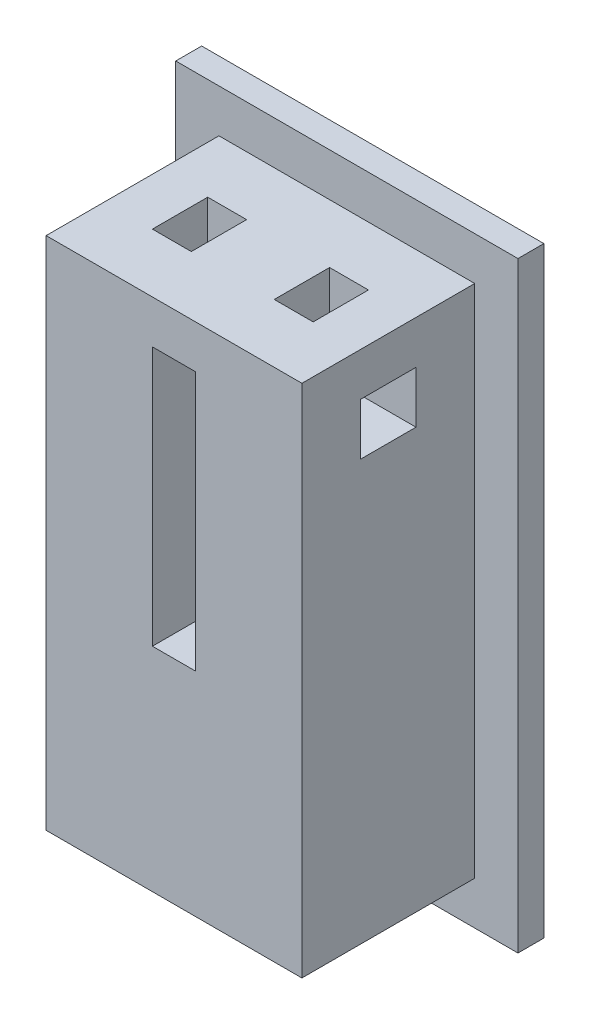
ISO-10303-21;
HEADER;
FILE_DESCRIPTION(('STEP AP214'),'2;1');
FILE_NAME('part.step','',(''),(''),'','','');
FILE_SCHEMA(('AUTOMOTIVE_DESIGN { 1 0 10303 214 1 1 1 1 }'));
ENDSEC;
DATA;
#1=APPLICATION_CONTEXT('core data for automotive mechanical design processes');
#2=APPLICATION_PROTOCOL_DEFINITION('international standard','automotive_design',2000,#1);
#3=PRODUCT_CONTEXT('',#1,'mechanical');
#4=PRODUCT('Part','Part','',(#3));
#5=PRODUCT_RELATED_PRODUCT_CATEGORY('part','',(#4));
#6=PRODUCT_DEFINITION_FORMATION('','',#4);
#7=PRODUCT_DEFINITION_CONTEXT('part definition',#1,'design');
#8=PRODUCT_DEFINITION('design','',#6,#7);
#9=PRODUCT_DEFINITION_SHAPE('','',#8);
#10=(LENGTH_UNIT() NAMED_UNIT(*) SI_UNIT(.MILLI.,.METRE.));
#11=(NAMED_UNIT(*) PLANE_ANGLE_UNIT() SI_UNIT($,.RADIAN.));
#12=(NAMED_UNIT(*) SI_UNIT($,.STERADIAN.) SOLID_ANGLE_UNIT());
#13=UNCERTAINTY_MEASURE_WITH_UNIT(LENGTH_MEASURE(1.E-05),#10,'distance_accuracy_value','');
#14=(GEOMETRIC_REPRESENTATION_CONTEXT(3) GLOBAL_UNCERTAINTY_ASSIGNED_CONTEXT((#13)) GLOBAL_UNIT_ASSIGNED_CONTEXT((#10,
#11,#12)) REPRESENTATION_CONTEXT('',''));
#15=CARTESIAN_POINT('',(0.,0.,0.));
#16=DIRECTION('',(0.,0.,1.));
#17=DIRECTION('',(1.,0.,0.));
#18=AXIS2_PLACEMENT_3D('',#15,#16,#17);
#19=CARTESIAN_POINT('',(0.,0.,20.));
#20=DIRECTION('',(0.,0.,1.));
#21=DIRECTION('',(1.,0.,0.));
#22=AXIS2_PLACEMENT_3D('',#19,#20,#21);
#23=PLANE('',#22);
#24=DIRECTION('',(0.,-1.,0.));
#25=VECTOR('',#24,1.);
#26=CARTESIAN_POINT('',(-14.8,29.8,20.));
#27=LINE('',#26,#25);
#28=CARTESIAN_POINT('',(-14.8,29.8,20.));
#29=VERTEX_POINT('',#28);
#30=CARTESIAN_POINT('',(-14.8,-29.8,20.));
#31=VERTEX_POINT('',#30);
#32=EDGE_CURVE('E401',#29,#31,#27,.T.);
#33=ORIENTED_EDGE('',*,*,#32,.T.);
#34=DIRECTION('',(1.,0.,0.));
#35=VECTOR('',#34,1.);
#36=CARTESIAN_POINT('',(-14.8,-29.8,20.));
#37=LINE('',#36,#35);
#38=CARTESIAN_POINT('',(14.8,-29.8,20.));
#39=VERTEX_POINT('',#38);
#40=EDGE_CURVE('E404',#31,#39,#37,.T.);
#41=ORIENTED_EDGE('',*,*,#40,.T.);
#42=DIRECTION('',(0.,1.,0.));
#43=VECTOR('',#42,1.);
#44=CARTESIAN_POINT('',(14.8,29.8,20.));
#45=LINE('',#44,#43);
#46=CARTESIAN_POINT('',(14.8,29.8,20.));
#47=VERTEX_POINT('',#46);
#48=EDGE_CURVE('E407',#39,#47,#45,.T.);
#49=ORIENTED_EDGE('',*,*,#48,.T.);
#50=DIRECTION('',(-1.,0.,0.));
#51=VECTOR('',#50,1.);
#52=CARTESIAN_POINT('',(-14.8,29.8,20.));
#53=LINE('',#52,#51);
#54=EDGE_CURVE('E409',#47,#29,#53,.T.);
#55=ORIENTED_EDGE('',*,*,#54,.T.);
#56=EDGE_LOOP('',(#33,#41,#49,#55));
#57=FACE_BOUND('',#56,.T.);
#58=DIRECTION('',(1.,0.,0.));
#59=VECTOR('',#58,1.);
#60=CARTESIAN_POINT('',(-2.5,-5.19999999999999,20.));
#61=LINE('',#60,#59);
#62=CARTESIAN_POINT('',(-2.5,-5.19999999999999,20.));
#63=VERTEX_POINT('',#62);
#64=CARTESIAN_POINT('',(2.5,-5.19999999999999,20.));
#65=VERTEX_POINT('',#64);
#66=EDGE_CURVE('E381',#63,#65,#61,.T.);
#67=ORIENTED_EDGE('',*,*,#66,.F.);
#68=DIRECTION('',(0.,-1.,0.));
#69=VECTOR('',#68,1.);
#70=CARTESIAN_POINT('',(-2.5,24.8,20.));
#71=LINE('',#70,#69);
#72=CARTESIAN_POINT('',(-2.5,24.8,20.));
#73=VERTEX_POINT('',#72);
#74=EDGE_CURVE('E379',#73,#63,#71,.T.);
#75=ORIENTED_EDGE('',*,*,#74,.F.);
#76=DIRECTION('',(-1.,0.,0.));
#77=VECTOR('',#76,1.);
#78=CARTESIAN_POINT('',(-2.5,24.8,20.));
#79=LINE('',#78,#77);
#80=CARTESIAN_POINT('',(2.5,24.8,20.));
#81=VERTEX_POINT('',#80);
#82=EDGE_CURVE('E386',#81,#73,#79,.T.);
#83=ORIENTED_EDGE('',*,*,#82,.F.);
#84=DIRECTION('',(0.,1.,0.));
#85=VECTOR('',#84,1.);
#86=CARTESIAN_POINT('',(2.5,24.8,20.));
#87=LINE('',#86,#85);
#88=EDGE_CURVE('E383',#65,#81,#87,.T.);
#89=ORIENTED_EDGE('',*,*,#88,.F.);
#90=EDGE_LOOP('',(#67,#75,#83,#89));
#91=FACE_BOUND('',#90,.T.);
#92=ADVANCED_FACE('F37',(#57,#91),#23,.T.);
#93=CARTESIAN_POINT('',(-14.8,29.8,20.));
#94=DIRECTION('',(1.,0.,0.));
#95=DIRECTION('',(0.,0.,-1.));
#96=AXIS2_PLACEMENT_3D('',#93,#94,#95);
#97=PLANE('',#96);
#98=DIRECTION('',(0.,0.,1.));
#99=VECTOR('',#98,1.);
#100=CARTESIAN_POINT('',(-14.8,18.8,6.8));
#101=LINE('',#100,#99);
#102=CARTESIAN_POINT('',(-14.8,18.8,6.8));
#103=VERTEX_POINT('',#102);
#104=CARTESIAN_POINT('',(-14.8,18.8,13.2));
#105=VERTEX_POINT('',#104);
#106=EDGE_CURVE('E237',#103,#105,#101,.T.);
#107=ORIENTED_EDGE('',*,*,#106,.F.);
#108=DIRECTION('',(0.,-1.,0.));
#109=VECTOR('',#108,1.);
#110=CARTESIAN_POINT('',(-14.8,18.8,6.8));
#111=LINE('',#110,#109);
#112=CARTESIAN_POINT('',(-14.8,24.8,6.8));
#113=VERTEX_POINT('',#112);
#114=EDGE_CURVE('E241',#113,#103,#111,.T.);
#115=ORIENTED_EDGE('',*,*,#114,.F.);
#116=DIRECTION('',(0.,0.,-1.));
#117=VECTOR('',#116,1.);
#118=CARTESIAN_POINT('',(-14.8,24.8,6.8));
#119=LINE('',#118,#117);
#120=CARTESIAN_POINT('',(-14.8,24.8,13.2));
#121=VERTEX_POINT('',#120);
#122=EDGE_CURVE('E245',#121,#113,#119,.T.);
#123=ORIENTED_EDGE('',*,*,#122,.F.);
#124=DIRECTION('',(0.,1.,0.));
#125=VECTOR('',#124,1.);
#126=CARTESIAN_POINT('',(-14.8,18.8,13.2));
#127=LINE('',#126,#125);
#128=EDGE_CURVE('E229',#105,#121,#127,.T.);
#129=ORIENTED_EDGE('',*,*,#128,.F.);
#130=EDGE_LOOP('',(#107,#115,#123,#129));
#131=FACE_BOUND('',#130,.T.);
#132=DIRECTION('',(0.,-1.,0.));
#133=VECTOR('',#132,1.);
#134=CARTESIAN_POINT('',(-14.8,29.8,0.));
#135=LINE('',#134,#133);
#136=CARTESIAN_POINT('',(-14.8,29.8,0.));
#137=VERTEX_POINT('',#136);
#138=CARTESIAN_POINT('',(-14.8,-29.8,0.));
#139=VERTEX_POINT('',#138);
#140=EDGE_CURVE('E400',#137,#139,#135,.T.);
#141=ORIENTED_EDGE('',*,*,#140,.T.);
#142=DIRECTION('',(0.,0.,-1.));
#143=VECTOR('',#142,1.);
#144=CARTESIAN_POINT('',(-14.8,-29.8,20.));
#145=LINE('',#144,#143);
#146=EDGE_CURVE('E11',#31,#139,#145,.T.);
#147=ORIENTED_EDGE('',*,*,#146,.F.);
#148=ORIENTED_EDGE('',*,*,#32,.F.);
#149=DIRECTION('',(0.,0.,-1.));
#150=VECTOR('',#149,1.);
#151=CARTESIAN_POINT('',(-14.8,29.8,20.));
#152=LINE('',#151,#150);
#153=EDGE_CURVE('E411',#29,#137,#152,.T.);
#154=ORIENTED_EDGE('',*,*,#153,.T.);
#155=EDGE_LOOP('',(#141,#147,#148,#154));
#156=FACE_BOUND('',#155,.T.);
#157=ADVANCED_FACE('F39',(#131,#156),#97,.F.);
#158=CARTESIAN_POINT('',(-14.8,-29.8,20.));
#159=DIRECTION('',(0.,1.,0.));
#160=DIRECTION('',(-1.,0.,0.));
#161=AXIS2_PLACEMENT_3D('',#158,#159,#160);
#162=PLANE('',#161);
#163=DIRECTION('',(1.,0.,0.));
#164=VECTOR('',#163,1.);
#165=CARTESIAN_POINT('',(-14.8,-29.8,0.));
#166=LINE('',#165,#164);
#167=CARTESIAN_POINT('',(14.8,-29.8,0.));
#168=VERTEX_POINT('',#167);
#169=EDGE_CURVE('E414',#139,#168,#166,.T.);
#170=ORIENTED_EDGE('',*,*,#169,.T.);
#171=DIRECTION('',(0.,0.,-1.));
#172=VECTOR('',#171,1.);
#173=CARTESIAN_POINT('',(14.8,-29.8,20.));
#174=LINE('',#173,#172);
#175=EDGE_CURVE('E45',#39,#168,#174,.T.);
#176=ORIENTED_EDGE('',*,*,#175,.F.);
#177=ORIENTED_EDGE('',*,*,#40,.F.);
#178=ORIENTED_EDGE('',*,*,#146,.T.);
#179=EDGE_LOOP('',(#170,#176,#177,#178));
#180=FACE_BOUND('',#179,.T.);
#181=ADVANCED_FACE('F433',(#180),#162,.F.);
#182=CARTESIAN_POINT('',(14.8,29.8,20.));
#183=DIRECTION('',(-1.,0.,0.));
#184=DIRECTION('',(0.,-1.,0.));
#185=AXIS2_PLACEMENT_3D('',#182,#183,#184);
#186=PLANE('',#185);
#187=DIRECTION('',(0.,0.,-1.));
#188=VECTOR('',#187,1.);
#189=CARTESIAN_POINT('',(14.8,24.8,20.));
#190=LINE('',#189,#188);
#191=CARTESIAN_POINT('',(14.8,24.8,13.2));
#192=VERTEX_POINT('',#191);
#193=CARTESIAN_POINT('',(14.8,24.8,6.8));
#194=VERTEX_POINT('',#193);
#195=EDGE_CURVE('E291',#192,#194,#190,.T.);
#196=ORIENTED_EDGE('',*,*,#195,.T.);
#197=DIRECTION('',(0.,-1.,0.));
#198=VECTOR('',#197,1.);
#199=CARTESIAN_POINT('',(14.8,29.8,6.8));
#200=LINE('',#199,#198);
#201=CARTESIAN_POINT('',(14.8,18.8,6.8));
#202=VERTEX_POINT('',#201);
#203=EDGE_CURVE('E269',#194,#202,#200,.T.);
#204=ORIENTED_EDGE('',*,*,#203,.T.);
#205=DIRECTION('',(0.,0.,1.));
#206=VECTOR('',#205,1.);
#207=CARTESIAN_POINT('',(14.8,18.8,20.));
#208=LINE('',#207,#206);
#209=CARTESIAN_POINT('',(14.8,18.8,13.2));
#210=VERTEX_POINT('',#209);
#211=EDGE_CURVE('E276',#202,#210,#208,.T.);
#212=ORIENTED_EDGE('',*,*,#211,.T.);
#213=DIRECTION('',(0.,1.,0.));
#214=VECTOR('',#213,1.);
#215=CARTESIAN_POINT('',(14.8,29.8,13.2));
#216=LINE('',#215,#214);
#217=EDGE_CURVE('E261',#210,#192,#216,.T.);
#218=ORIENTED_EDGE('',*,*,#217,.T.);
#219=EDGE_LOOP('',(#196,#204,#212,#218));
#220=FACE_BOUND('',#219,.T.);
#221=DIRECTION('',(0.,1.,0.));
#222=VECTOR('',#221,1.);
#223=CARTESIAN_POINT('',(14.8,29.8,0.));
#224=LINE('',#223,#222);
#225=CARTESIAN_POINT('',(14.8,29.8,0.));
#226=VERTEX_POINT('',#225);
#227=EDGE_CURVE('E417',#168,#226,#224,.T.);
#228=ORIENTED_EDGE('',*,*,#227,.T.);
#229=DIRECTION('',(0.,0.,-1.));
#230=VECTOR('',#229,1.);
#231=CARTESIAN_POINT('',(14.8,29.8,20.));
#232=LINE('',#231,#230);
#233=EDGE_CURVE('E424',#47,#226,#232,.T.);
#234=ORIENTED_EDGE('',*,*,#233,.F.);
#235=ORIENTED_EDGE('',*,*,#48,.F.);
#236=ORIENTED_EDGE('',*,*,#175,.T.);
#237=EDGE_LOOP('',(#228,#234,#235,#236));
#238=FACE_BOUND('',#237,.T.);
#239=ADVANCED_FACE('F430',(#220,#238),#186,.F.);
#240=CARTESIAN_POINT('',(-14.8,29.8,20.));
#241=DIRECTION('',(0.,-1.,0.));
#242=DIRECTION('',(0.,0.,-1.));
#243=AXIS2_PLACEMENT_3D('',#240,#241,#242);
#244=PLANE('',#243);
#245=DIRECTION('',(1.,0.,0.));
#246=VECTOR('',#245,1.);
#247=CARTESIAN_POINT('',(-9.3,29.8,13.2));
#248=LINE('',#247,#246);
#249=CARTESIAN_POINT('',(-9.3,29.8,13.2));
#250=VERTEX_POINT('',#249);
#251=CARTESIAN_POINT('',(-4.8,29.8,13.2));
#252=VERTEX_POINT('',#251);
#253=EDGE_CURVE('E300',#250,#252,#248,.T.);
#254=ORIENTED_EDGE('',*,*,#253,.F.);
#255=DIRECTION('',(0.,0.,1.));
#256=VECTOR('',#255,1.);
#257=CARTESIAN_POINT('',(-9.3,29.8,6.8));
#258=LINE('',#257,#256);
#259=CARTESIAN_POINT('',(-9.3,29.8,6.8));
#260=VERTEX_POINT('',#259);
#261=EDGE_CURVE('E297',#260,#250,#258,.T.);
#262=ORIENTED_EDGE('',*,*,#261,.F.);
#263=DIRECTION('',(-1.,0.,0.));
#264=VECTOR('',#263,1.);
#265=CARTESIAN_POINT('',(-9.3,29.8,6.8));
#266=LINE('',#265,#264);
#267=CARTESIAN_POINT('',(-4.8,29.8,6.8));
#268=VERTEX_POINT('',#267);
#269=EDGE_CURVE('E234',#268,#260,#266,.T.);
#270=ORIENTED_EDGE('',*,*,#269,.F.);
#271=DIRECTION('',(0.,0.,-1.));
#272=VECTOR('',#271,1.);
#273=CARTESIAN_POINT('',(-4.8,29.8,6.8));
#274=LINE('',#273,#272);
#275=EDGE_CURVE('E304',#252,#268,#274,.T.);
#276=ORIENTED_EDGE('',*,*,#275,.F.);
#277=EDGE_LOOP('',(#254,#262,#270,#276));
#278=FACE_BOUND('',#277,.T.);
#279=DIRECTION('',(-1.,0.,0.));
#280=VECTOR('',#279,1.);
#281=CARTESIAN_POINT('',(9.3,29.8,6.8));
#282=LINE('',#281,#280);
#283=CARTESIAN_POINT('',(9.29999999999999,29.8,6.8));
#284=VERTEX_POINT('',#283);
#285=CARTESIAN_POINT('',(4.8,29.8,6.8));
#286=VERTEX_POINT('',#285);
#287=EDGE_CURVE('E331',#284,#286,#282,.T.);
#288=ORIENTED_EDGE('',*,*,#287,.F.);
#289=DIRECTION('',(0.,0.,-1.));
#290=VECTOR('',#289,1.);
#291=CARTESIAN_POINT('',(9.3,29.8,6.8));
#292=LINE('',#291,#290);
#293=CARTESIAN_POINT('',(9.3,29.8,13.2));
#294=VERTEX_POINT('',#293);
#295=EDGE_CURVE('E301',#294,#284,#292,.T.);
#296=ORIENTED_EDGE('',*,*,#295,.F.);
#297=DIRECTION('',(1.,0.,0.));
#298=VECTOR('',#297,1.);
#299=CARTESIAN_POINT('',(9.3,29.8,13.2));
#300=LINE('',#299,#298);
#301=CARTESIAN_POINT('',(4.8,29.8,13.2));
#302=VERTEX_POINT('',#301);
#303=EDGE_CURVE('E324',#302,#294,#300,.T.);
#304=ORIENTED_EDGE('',*,*,#303,.F.);
#305=DIRECTION('',(0.,0.,1.));
#306=VECTOR('',#305,1.);
#307=CARTESIAN_POINT('',(4.8,29.8,6.8));
#308=LINE('',#307,#306);
#309=EDGE_CURVE('E327',#286,#302,#308,.T.);
#310=ORIENTED_EDGE('',*,*,#309,.F.);
#311=EDGE_LOOP('',(#288,#296,#304,#310));
#312=FACE_BOUND('',#311,.T.);
#313=DIRECTION('',(-1.,0.,0.));
#314=VECTOR('',#313,1.);
#315=CARTESIAN_POINT('',(-14.8,29.8,0.));
#316=LINE('',#315,#314);
#317=EDGE_CURVE('E405',#226,#137,#316,.T.);
#318=ORIENTED_EDGE('',*,*,#317,.T.);
#319=ORIENTED_EDGE('',*,*,#153,.F.);
#320=ORIENTED_EDGE('',*,*,#54,.F.);
#321=ORIENTED_EDGE('',*,*,#233,.T.);
#322=EDGE_LOOP('',(#318,#319,#320,#321));
#323=FACE_BOUND('',#322,.T.);
#324=ADVANCED_FACE('F440',(#278,#312,#323),#244,.F.);
#325=CARTESIAN_POINT('',(-2.5,24.8,20.));
#326=DIRECTION('',(1.,0.,0.));
#327=DIRECTION('',(0.,1.,0.));
#328=AXIS2_PLACEMENT_3D('',#325,#326,#327);
#329=PLANE('',#328);
#330=DIRECTION('',(0.,1.,0.));
#331=VECTOR('',#330,1.);
#332=CARTESIAN_POINT('',(-2.5,24.8,6.8));
#333=LINE('',#332,#331);
#334=CARTESIAN_POINT('',(-2.5,18.8,6.8));
#335=VERTEX_POINT('',#334);
#336=CARTESIAN_POINT('',(-2.5,24.8,6.8));
#337=VERTEX_POINT('',#336);
#338=EDGE_CURVE('E267',#335,#337,#333,.T.);
#339=ORIENTED_EDGE('',*,*,#338,.F.);
#340=DIRECTION('',(0.,0.,-1.));
#341=VECTOR('',#340,1.);
#342=CARTESIAN_POINT('',(-2.5,18.8,20.));
#343=LINE('',#342,#341);
#344=CARTESIAN_POINT('',(-2.5,18.8,13.2));
#345=VERTEX_POINT('',#344);
#346=EDGE_CURVE('E274',#345,#335,#343,.T.);
#347=ORIENTED_EDGE('',*,*,#346,.F.);
#348=DIRECTION('',(0.,-1.,0.));
#349=VECTOR('',#348,1.);
#350=CARTESIAN_POINT('',(-2.5,24.8,13.2));
#351=LINE('',#350,#349);
#352=CARTESIAN_POINT('',(-2.5,24.8,13.2));
#353=VERTEX_POINT('',#352);
#354=EDGE_CURVE('E232',#353,#345,#351,.T.);
#355=ORIENTED_EDGE('',*,*,#354,.F.);
#356=DIRECTION('',(0.,0.,-1.));
#357=VECTOR('',#356,1.);
#358=CARTESIAN_POINT('',(-2.5,24.8,20.));
#359=LINE('',#358,#357);
#360=EDGE_CURVE('E389',#73,#353,#359,.T.);
#361=ORIENTED_EDGE('',*,*,#360,.F.);
#362=ORIENTED_EDGE('',*,*,#74,.T.);
#363=DIRECTION('',(0.,0.,-1.));
#364=VECTOR('',#363,1.);
#365=CARTESIAN_POINT('',(-2.5,-5.19999999999999,20.));
#366=LINE('',#365,#364);
#367=CARTESIAN_POINT('',(-2.5,-5.19999999999999,-3.));
#368=VERTEX_POINT('',#367);
#369=EDGE_CURVE('E398',#63,#368,#366,.T.);
#370=ORIENTED_EDGE('',*,*,#369,.T.);
#371=DIRECTION('',(0.,1.,0.));
#372=VECTOR('',#371,1.);
#373=CARTESIAN_POINT('',(-2.5,24.8,-3.));
#374=LINE('',#373,#372);
#375=CARTESIAN_POINT('',(-2.5,24.8,-3.));
#376=VERTEX_POINT('',#375);
#377=EDGE_CURVE('E343',#368,#376,#374,.T.);
#378=ORIENTED_EDGE('',*,*,#377,.T.);
#379=EDGE_CURVE('E388',#337,#376,#359,.T.);
#380=ORIENTED_EDGE('',*,*,#379,.F.);
#381=EDGE_LOOP('',(#339,#347,#355,#361,#362,#370,#378,#380));
#382=FACE_BOUND('',#381,.T.);
#383=ADVANCED_FACE('F468',(#382),#329,.T.);
#384=CARTESIAN_POINT('',(-2.5,-5.19999999999999,20.));
#385=DIRECTION('',(0.,1.,0.));
#386=DIRECTION('',(-1.,0.,0.));
#387=AXIS2_PLACEMENT_3D('',#384,#385,#386);
#388=PLANE('',#387);
#389=DIRECTION('',(0.,0.,-1.));
#390=VECTOR('',#389,1.);
#391=CARTESIAN_POINT('',(2.5,-5.19999999999999,20.));
#392=LINE('',#391,#390);
#393=CARTESIAN_POINT('',(2.49999999999999,-5.19999999999999,-3.));
#394=VERTEX_POINT('',#393);
#395=EDGE_CURVE('E396',#65,#394,#392,.T.);
#396=ORIENTED_EDGE('',*,*,#395,.T.);
#397=DIRECTION('',(-1.,0.,0.));
#398=VECTOR('',#397,1.);
#399=CARTESIAN_POINT('',(2.49999999999999,-5.19999999999999,-3.));
#400=LINE('',#399,#398);
#401=EDGE_CURVE('E340',#394,#368,#400,.T.);
#402=ORIENTED_EDGE('',*,*,#401,.T.);
#403=ORIENTED_EDGE('',*,*,#369,.F.);
#404=ORIENTED_EDGE('',*,*,#66,.T.);
#405=EDGE_LOOP('',(#396,#402,#403,#404));
#406=FACE_BOUND('',#405,.T.);
#407=ADVANCED_FACE('F454',(#406),#388,.T.);
#408=CARTESIAN_POINT('',(2.5,24.8,20.));
#409=DIRECTION('',(-1.,0.,0.));
#410=DIRECTION('',(0.,-1.,0.));
#411=AXIS2_PLACEMENT_3D('',#408,#409,#410);
#412=PLANE('',#411);
#413=DIRECTION('',(0.,-1.,0.));
#414=VECTOR('',#413,1.);
#415=CARTESIAN_POINT('',(2.5,24.8,6.8));
#416=LINE('',#415,#414);
#417=CARTESIAN_POINT('',(2.5,24.8,6.8));
#418=VERTEX_POINT('',#417);
#419=CARTESIAN_POINT('',(2.5,18.8,6.8));
#420=VERTEX_POINT('',#419);
#421=EDGE_CURVE('E264',#418,#420,#416,.T.);
#422=ORIENTED_EDGE('',*,*,#421,.F.);
#423=DIRECTION('',(0.,0.,-1.));
#424=VECTOR('',#423,1.);
#425=CARTESIAN_POINT('',(2.5,24.8,20.));
#426=LINE('',#425,#424);
#427=CARTESIAN_POINT('',(2.5,24.8,-3.));
#428=VERTEX_POINT('',#427);
#429=EDGE_CURVE('E392',#418,#428,#426,.T.);
#430=ORIENTED_EDGE('',*,*,#429,.T.);
#431=DIRECTION('',(0.,-1.,0.));
#432=VECTOR('',#431,1.);
#433=CARTESIAN_POINT('',(2.5,24.8,-3.));
#434=LINE('',#433,#432);
#435=EDGE_CURVE('E311',#428,#394,#434,.T.);
#436=ORIENTED_EDGE('',*,*,#435,.T.);
#437=ORIENTED_EDGE('',*,*,#395,.F.);
#438=ORIENTED_EDGE('',*,*,#88,.T.);
#439=CARTESIAN_POINT('',(2.5,24.8,13.2));
#440=VERTEX_POINT('',#439);
#441=EDGE_CURVE('E393',#81,#440,#426,.T.);
#442=ORIENTED_EDGE('',*,*,#441,.T.);
#443=DIRECTION('',(0.,1.,0.));
#444=VECTOR('',#443,1.);
#445=CARTESIAN_POINT('',(2.5,24.8,13.2));
#446=LINE('',#445,#444);
#447=CARTESIAN_POINT('',(2.5,18.8,13.2));
#448=VERTEX_POINT('',#447);
#449=EDGE_CURVE('E258',#448,#440,#446,.T.);
#450=ORIENTED_EDGE('',*,*,#449,.F.);
#451=DIRECTION('',(0.,0.,1.));
#452=VECTOR('',#451,1.);
#453=CARTESIAN_POINT('',(2.5,18.8,20.));
#454=LINE('',#453,#452);
#455=EDGE_CURVE('E272',#420,#448,#454,.T.);
#456=ORIENTED_EDGE('',*,*,#455,.F.);
#457=EDGE_LOOP('',(#422,#430,#436,#437,#438,#442,#450,#456));
#458=FACE_BOUND('',#457,.T.);
#459=ADVANCED_FACE('F457',(#458),#412,.T.);
#460=CARTESIAN_POINT('',(-2.5,24.8,20.));
#461=DIRECTION('',(0.,-1.,0.));
#462=DIRECTION('',(0.,0.,-1.));
#463=AXIS2_PLACEMENT_3D('',#460,#461,#462);
#464=PLANE('',#463);
#465=ORIENTED_EDGE('',*,*,#360,.T.);
#466=DIRECTION('',(-1.,0.,0.));
#467=VECTOR('',#466,1.);
#468=CARTESIAN_POINT('',(19.8,24.8,13.2));
#469=LINE('',#468,#467);
#470=CARTESIAN_POINT('',(-4.8,24.8,13.2));
#471=VERTEX_POINT('',#470);
#472=EDGE_CURVE('E257',#353,#471,#469,.T.);
#473=ORIENTED_EDGE('',*,*,#472,.T.);
#474=DIRECTION('',(0.,0.,1.));
#475=VECTOR('',#474,1.);
#476=CARTESIAN_POINT('',(-4.8,24.8,6.8));
#477=LINE('',#476,#475);
#478=CARTESIAN_POINT('',(-4.8,24.8,6.8));
#479=VERTEX_POINT('',#478);
#480=EDGE_CURVE('E279',#479,#471,#477,.T.);
#481=ORIENTED_EDGE('',*,*,#480,.F.);
#482=DIRECTION('',(-1.,0.,0.));
#483=VECTOR('',#482,1.);
#484=CARTESIAN_POINT('',(19.8,24.8,6.8));
#485=LINE('',#484,#483);
#486=EDGE_CURVE('E253',#337,#479,#485,.T.);
#487=ORIENTED_EDGE('',*,*,#486,.F.);
#488=ORIENTED_EDGE('',*,*,#379,.T.);
#489=DIRECTION('',(1.,0.,0.));
#490=VECTOR('',#489,1.);
#491=CARTESIAN_POINT('',(2.5,24.8,-3.));
#492=LINE('',#491,#490);
#493=EDGE_CURVE('E346',#376,#428,#492,.T.);
#494=ORIENTED_EDGE('',*,*,#493,.T.);
#495=ORIENTED_EDGE('',*,*,#429,.F.);
#496=CARTESIAN_POINT('',(4.8,24.8,6.8));
#497=VERTEX_POINT('',#496);
#498=EDGE_CURVE('E486',#497,#418,#485,.T.);
#499=ORIENTED_EDGE('',*,*,#498,.F.);
#500=DIRECTION('',(0.,0.,-1.));
#501=VECTOR('',#500,1.);
#502=CARTESIAN_POINT('',(4.8,24.8,6.8));
#503=LINE('',#502,#501);
#504=CARTESIAN_POINT('',(4.8,24.8,13.2));
#505=VERTEX_POINT('',#504);
#506=EDGE_CURVE('E285',#505,#497,#503,.T.);
#507=ORIENTED_EDGE('',*,*,#506,.F.);
#508=EDGE_CURVE('E474',#505,#440,#469,.T.);
#509=ORIENTED_EDGE('',*,*,#508,.T.);
#510=ORIENTED_EDGE('',*,*,#441,.F.);
#511=ORIENTED_EDGE('',*,*,#82,.T.);
#512=EDGE_LOOP('',(#465,#473,#481,#487,#488,#494,#495,#499,#507,#509,#510,#511));
#513=FACE_BOUND('',#512,.T.);
#514=ADVANCED_FACE('F471',(#513),#464,.T.);
#515=CARTESIAN_POINT('',(0.,0.,-3.));
#516=DIRECTION('',(0.,0.,-1.));
#517=DIRECTION('',(-1.,0.,0.));
#518=AXIS2_PLACEMENT_3D('',#515,#516,#517);
#519=PLANE('',#518);
#520=DIRECTION('',(0.,-1.,0.));
#521=VECTOR('',#520,1.);
#522=CARTESIAN_POINT('',(19.8,34.8,-3.));
#523=LINE('',#522,#521);
#524=CARTESIAN_POINT('',(19.8,34.8,-3.));
#525=VERTEX_POINT('',#524);
#526=CARTESIAN_POINT('',(19.8,-34.8,-3.));
#527=VERTEX_POINT('',#526);
#528=EDGE_CURVE('E350',#525,#527,#523,.T.);
#529=ORIENTED_EDGE('',*,*,#528,.T.);
#530=DIRECTION('',(-1.,0.,0.));
#531=VECTOR('',#530,1.);
#532=CARTESIAN_POINT('',(19.8,-34.8,-3.));
#533=LINE('',#532,#531);
#534=CARTESIAN_POINT('',(-19.8,-34.8,-3.));
#535=VERTEX_POINT('',#534);
#536=EDGE_CURVE('E353',#527,#535,#533,.T.);
#537=ORIENTED_EDGE('',*,*,#536,.T.);
#538=DIRECTION('',(0.,1.,0.));
#539=VECTOR('',#538,1.);
#540=CARTESIAN_POINT('',(-19.8,34.8,-3.));
#541=LINE('',#540,#539);
#542=CARTESIAN_POINT('',(-19.8,34.8,-3.));
#543=VERTEX_POINT('',#542);
#544=EDGE_CURVE('E356',#535,#543,#541,.T.);
#545=ORIENTED_EDGE('',*,*,#544,.T.);
#546=DIRECTION('',(1.,0.,0.));
#547=VECTOR('',#546,1.);
#548=CARTESIAN_POINT('',(19.8,34.8,-3.));
#549=LINE('',#548,#547);
#550=EDGE_CURVE('E358',#543,#525,#549,.T.);
#551=ORIENTED_EDGE('',*,*,#550,.T.);
#552=EDGE_LOOP('',(#529,#537,#545,#551));
#553=FACE_BOUND('',#552,.T.);
#554=ORIENTED_EDGE('',*,*,#401,.F.);
#555=ORIENTED_EDGE('',*,*,#435,.F.);
#556=ORIENTED_EDGE('',*,*,#493,.F.);
#557=ORIENTED_EDGE('',*,*,#377,.F.);
#558=EDGE_LOOP('',(#554,#555,#556,#557));
#559=FACE_BOUND('',#558,.T.);
#560=ADVANCED_FACE('F464',(#553,#559),#519,.T.);
#561=CARTESIAN_POINT('',(0.,0.,0.));
#562=DIRECTION('',(0.,0.,-1.));
#563=DIRECTION('',(-1.,0.,0.));
#564=AXIS2_PLACEMENT_3D('',#561,#562,#563);
#565=PLANE('',#564);
#566=ORIENTED_EDGE('',*,*,#140,.F.);
#567=ORIENTED_EDGE('',*,*,#317,.F.);
#568=ORIENTED_EDGE('',*,*,#227,.F.);
#569=ORIENTED_EDGE('',*,*,#169,.F.);
#570=EDGE_LOOP('',(#566,#567,#568,#569));
#571=FACE_BOUND('',#570,.T.);
#572=DIRECTION('',(0.,-1.,0.));
#573=VECTOR('',#572,1.);
#574=CARTESIAN_POINT('',(19.8,34.8,0.));
#575=LINE('',#574,#573);
#576=CARTESIAN_POINT('',(19.8,34.8,0.));
#577=VERTEX_POINT('',#576);
#578=CARTESIAN_POINT('',(19.8,-34.8,0.));
#579=VERTEX_POINT('',#578);
#580=EDGE_CURVE('E349',#577,#579,#575,.T.);
#581=ORIENTED_EDGE('',*,*,#580,.F.);
#582=DIRECTION('',(1.,0.,0.));
#583=VECTOR('',#582,1.);
#584=CARTESIAN_POINT('',(19.8,34.8,0.));
#585=LINE('',#584,#583);
#586=CARTESIAN_POINT('',(-19.8,34.8,0.));
#587=VERTEX_POINT('',#586);
#588=EDGE_CURVE('E354',#587,#577,#585,.T.);
#589=ORIENTED_EDGE('',*,*,#588,.F.);
#590=DIRECTION('',(0.,1.,0.));
#591=VECTOR('',#590,1.);
#592=CARTESIAN_POINT('',(-19.8,34.8,0.));
#593=LINE('',#592,#591);
#594=CARTESIAN_POINT('',(-19.8,-34.8,0.));
#595=VERTEX_POINT('',#594);
#596=EDGE_CURVE('E365',#595,#587,#593,.T.);
#597=ORIENTED_EDGE('',*,*,#596,.F.);
#598=DIRECTION('',(-1.,0.,0.));
#599=VECTOR('',#598,1.);
#600=CARTESIAN_POINT('',(19.8,-34.8,0.));
#601=LINE('',#600,#599);
#602=EDGE_CURVE('E363',#579,#595,#601,.T.);
#603=ORIENTED_EDGE('',*,*,#602,.F.);
#604=EDGE_LOOP('',(#581,#589,#597,#603));
#605=FACE_BOUND('',#604,.T.);
#606=ADVANCED_FACE('F436',(#571,#605),#565,.F.);
#607=CARTESIAN_POINT('',(19.8,34.8,-3.));
#608=DIRECTION('',(-1.,0.,0.));
#609=DIRECTION('',(0.,0.,1.));
#610=AXIS2_PLACEMENT_3D('',#607,#608,#609);
#611=PLANE('',#610);
#612=ORIENTED_EDGE('',*,*,#580,.T.);
#613=DIRECTION('',(0.,0.,1.));
#614=VECTOR('',#613,1.);
#615=CARTESIAN_POINT('',(19.8,-34.8,-3.));
#616=LINE('',#615,#614);
#617=EDGE_CURVE('E376',#527,#579,#616,.T.);
#618=ORIENTED_EDGE('',*,*,#617,.F.);
#619=ORIENTED_EDGE('',*,*,#528,.F.);
#620=DIRECTION('',(0.,0.,1.));
#621=VECTOR('',#620,1.);
#622=CARTESIAN_POINT('',(19.8,34.8,-3.));
#623=LINE('',#622,#621);
#624=EDGE_CURVE('E360',#525,#577,#623,.T.);
#625=ORIENTED_EDGE('',*,*,#624,.T.);
#626=EDGE_LOOP('',(#612,#618,#619,#625));
#627=FACE_BOUND('',#626,.T.);
#628=ADVANCED_FACE('F545',(#627),#611,.F.);
#629=CARTESIAN_POINT('',(19.8,-34.8,-3.));
#630=DIRECTION('',(0.,1.,0.));
#631=DIRECTION('',(0.,0.,1.));
#632=AXIS2_PLACEMENT_3D('',#629,#630,#631);
#633=PLANE('',#632);
#634=ORIENTED_EDGE('',*,*,#602,.T.);
#635=DIRECTION('',(0.,0.,1.));
#636=VECTOR('',#635,1.);
#637=CARTESIAN_POINT('',(-19.8,-34.8,-3.));
#638=LINE('',#637,#636);
#639=EDGE_CURVE('E373',#535,#595,#638,.T.);
#640=ORIENTED_EDGE('',*,*,#639,.F.);
#641=ORIENTED_EDGE('',*,*,#536,.F.);
#642=ORIENTED_EDGE('',*,*,#617,.T.);
#643=EDGE_LOOP('',(#634,#640,#641,#642));
#644=FACE_BOUND('',#643,.T.);
#645=ADVANCED_FACE('F552',(#644),#633,.F.);
#646=CARTESIAN_POINT('',(-19.8,34.8,-3.));
#647=DIRECTION('',(1.,0.,0.));
#648=DIRECTION('',(0.,0.,-1.));
#649=AXIS2_PLACEMENT_3D('',#646,#647,#648);
#650=PLANE('',#649);
#651=ORIENTED_EDGE('',*,*,#596,.T.);
#652=DIRECTION('',(0.,0.,1.));
#653=VECTOR('',#652,1.);
#654=CARTESIAN_POINT('',(-19.8,34.8,-3.));
#655=LINE('',#654,#653);
#656=EDGE_CURVE('E370',#543,#587,#655,.T.);
#657=ORIENTED_EDGE('',*,*,#656,.F.);
#658=ORIENTED_EDGE('',*,*,#544,.F.);
#659=ORIENTED_EDGE('',*,*,#639,.T.);
#660=EDGE_LOOP('',(#651,#657,#658,#659));
#661=FACE_BOUND('',#660,.T.);
#662=ADVANCED_FACE('F548',(#661),#650,.F.);
#663=CARTESIAN_POINT('',(19.8,34.8,-3.));
#664=DIRECTION('',(0.,-1.,0.));
#665=DIRECTION('',(0.,0.,-1.));
#666=AXIS2_PLACEMENT_3D('',#663,#664,#665);
#667=PLANE('',#666);
#668=ORIENTED_EDGE('',*,*,#588,.T.);
#669=ORIENTED_EDGE('',*,*,#624,.F.);
#670=ORIENTED_EDGE('',*,*,#550,.F.);
#671=ORIENTED_EDGE('',*,*,#656,.T.);
#672=EDGE_LOOP('',(#668,#669,#670,#671));
#673=FACE_BOUND('',#672,.T.);
#674=ADVANCED_FACE('F531',(#673),#667,.F.);
#675=CARTESIAN_POINT('',(9.3,18.8,6.8));
#676=DIRECTION('',(1.,0.,0.));
#677=DIRECTION('',(0.,0.,-1.));
#678=AXIS2_PLACEMENT_3D('',#675,#676,#677);
#679=PLANE('',#678);
#680=DIRECTION('',(0.,1.,0.));
#681=VECTOR('',#680,1.);
#682=CARTESIAN_POINT('',(9.3,18.8,6.8));
#683=LINE('',#682,#681);
#684=CARTESIAN_POINT('',(9.3,24.8,6.8));
#685=VERTEX_POINT('',#684);
#686=EDGE_CURVE('E317',#685,#284,#683,.T.);
#687=ORIENTED_EDGE('',*,*,#686,.F.);
#688=DIRECTION('',(0.,0.,1.));
#689=VECTOR('',#688,1.);
#690=CARTESIAN_POINT('',(9.3,24.8,6.79999999999999));
#691=LINE('',#690,#689);
#692=CARTESIAN_POINT('',(9.3,24.8,13.2));
#693=VERTEX_POINT('',#692);
#694=EDGE_CURVE('E288',#685,#693,#691,.T.);
#695=ORIENTED_EDGE('',*,*,#694,.T.);
#696=DIRECTION('',(0.,1.,0.));
#697=VECTOR('',#696,1.);
#698=CARTESIAN_POINT('',(9.3,18.8,13.2));
#699=LINE('',#698,#697);
#700=EDGE_CURVE('E293',#693,#294,#699,.T.);
#701=ORIENTED_EDGE('',*,*,#700,.T.);
#702=ORIENTED_EDGE('',*,*,#295,.T.);
#703=EDGE_LOOP('',(#687,#695,#701,#702));
#704=FACE_BOUND('',#703,.T.);
#705=ADVANCED_FACE('F496',(#704),#679,.F.);
#706=CARTESIAN_POINT('',(9.3,18.8,13.2));
#707=DIRECTION('',(0.,0.,1.));
#708=DIRECTION('',(1.,0.,0.));
#709=AXIS2_PLACEMENT_3D('',#706,#707,#708);
#710=PLANE('',#709);
#711=ORIENTED_EDGE('',*,*,#700,.F.);
#712=EDGE_CURVE('E254',#192,#693,#469,.T.);
#713=ORIENTED_EDGE('',*,*,#712,.F.);
#714=ORIENTED_EDGE('',*,*,#217,.F.);
#715=DIRECTION('',(1.,0.,0.));
#716=VECTOR('',#715,1.);
#717=CARTESIAN_POINT('',(9.3,18.8,13.2));
#718=LINE('',#717,#716);
#719=EDGE_CURVE('E60',#448,#210,#718,.T.);
#720=ORIENTED_EDGE('',*,*,#719,.F.);
#721=ORIENTED_EDGE('',*,*,#449,.T.);
#722=ORIENTED_EDGE('',*,*,#508,.F.);
#723=DIRECTION('',(0.,1.,0.));
#724=VECTOR('',#723,1.);
#725=CARTESIAN_POINT('',(4.8,18.8,13.2));
#726=LINE('',#725,#724);
#727=EDGE_CURVE('E321',#505,#302,#726,.T.);
#728=ORIENTED_EDGE('',*,*,#727,.T.);
#729=ORIENTED_EDGE('',*,*,#303,.T.);
#730=EDGE_LOOP('',(#711,#713,#714,#720,#721,#722,#728,#729));
#731=FACE_BOUND('',#730,.T.);
#732=ADVANCED_FACE('F479',(#731),#710,.F.);
#733=CARTESIAN_POINT('',(4.8,18.8,6.8));
#734=DIRECTION('',(-1.,0.,0.));
#735=DIRECTION('',(0.,0.,1.));
#736=AXIS2_PLACEMENT_3D('',#733,#734,#735);
#737=PLANE('',#736);
#738=ORIENTED_EDGE('',*,*,#727,.F.);
#739=ORIENTED_EDGE('',*,*,#506,.T.);
#740=DIRECTION('',(0.,1.,0.));
#741=VECTOR('',#740,1.);
#742=CARTESIAN_POINT('',(4.8,18.8,6.8));
#743=LINE('',#742,#741);
#744=EDGE_CURVE('E319',#497,#286,#743,.T.);
#745=ORIENTED_EDGE('',*,*,#744,.T.);
#746=ORIENTED_EDGE('',*,*,#309,.T.);
#747=EDGE_LOOP('',(#738,#739,#745,#746));
#748=FACE_BOUND('',#747,.T.);
#749=ADVANCED_FACE('F503',(#748),#737,.F.);
#750=CARTESIAN_POINT('',(9.3,18.8,6.8));
#751=DIRECTION('',(0.,0.,-1.));
#752=DIRECTION('',(-1.,0.,0.));
#753=AXIS2_PLACEMENT_3D('',#750,#751,#752);
#754=PLANE('',#753);
#755=ORIENTED_EDGE('',*,*,#744,.F.);
#756=ORIENTED_EDGE('',*,*,#498,.T.);
#757=ORIENTED_EDGE('',*,*,#421,.T.);
#758=DIRECTION('',(-1.,0.,0.));
#759=VECTOR('',#758,1.);
#760=CARTESIAN_POINT('',(9.3,18.8,6.8));
#761=LINE('',#760,#759);
#762=EDGE_CURVE('E328',#202,#420,#761,.T.);
#763=ORIENTED_EDGE('',*,*,#762,.F.);
#764=ORIENTED_EDGE('',*,*,#203,.F.);
#765=EDGE_CURVE('E255',#194,#685,#485,.T.);
#766=ORIENTED_EDGE('',*,*,#765,.T.);
#767=ORIENTED_EDGE('',*,*,#686,.T.);
#768=ORIENTED_EDGE('',*,*,#287,.T.);
#769=EDGE_LOOP('',(#755,#756,#757,#763,#764,#766,#767,#768));
#770=FACE_BOUND('',#769,.T.);
#771=ADVANCED_FACE('F485',(#770),#754,.F.);
#772=CARTESIAN_POINT('',(0.,18.8,0.));
#773=DIRECTION('',(0.,-1.,0.));
#774=DIRECTION('',(0.,0.,-1.));
#775=AXIS2_PLACEMENT_3D('',#772,#773,#774);
#776=PLANE('',#775);
#777=ORIENTED_EDGE('',*,*,#719,.T.);
#778=ORIENTED_EDGE('',*,*,#211,.F.);
#779=ORIENTED_EDGE('',*,*,#762,.T.);
#780=ORIENTED_EDGE('',*,*,#455,.T.);
#781=EDGE_LOOP('',(#777,#778,#779,#780));
#782=FACE_BOUND('',#781,.T.);
#783=ADVANCED_FACE('F482',(#782),#776,.F.);
#784=CARTESIAN_POINT('',(-9.3,18.8,6.8));
#785=DIRECTION('',(-1.,0.,0.));
#786=DIRECTION('',(0.,0.,1.));
#787=AXIS2_PLACEMENT_3D('',#784,#785,#786);
#788=PLANE('',#787);
#789=DIRECTION('',(0.,1.,0.));
#790=VECTOR('',#789,1.);
#791=CARTESIAN_POINT('',(-9.3,18.8,13.2));
#792=LINE('',#791,#790);
#793=CARTESIAN_POINT('',(-9.3,24.8,13.2));
#794=VERTEX_POINT('',#793);
#795=EDGE_CURVE('E296',#794,#250,#792,.T.);
#796=ORIENTED_EDGE('',*,*,#795,.F.);
#797=DIRECTION('',(0.,0.,-1.));
#798=VECTOR('',#797,1.);
#799=CARTESIAN_POINT('',(-9.3,24.8,6.8));
#800=LINE('',#799,#798);
#801=CARTESIAN_POINT('',(-9.3,24.8,6.8));
#802=VERTEX_POINT('',#801);
#803=EDGE_CURVE('E282',#794,#802,#800,.T.);
#804=ORIENTED_EDGE('',*,*,#803,.T.);
#805=DIRECTION('',(0.,1.,0.));
#806=VECTOR('',#805,1.);
#807=CARTESIAN_POINT('',(-9.3,18.8,6.8));
#808=LINE('',#807,#806);
#809=EDGE_CURVE('E309',#802,#260,#808,.T.);
#810=ORIENTED_EDGE('',*,*,#809,.T.);
#811=ORIENTED_EDGE('',*,*,#261,.T.);
#812=EDGE_LOOP('',(#796,#804,#810,#811));
#813=FACE_BOUND('',#812,.T.);
#814=ADVANCED_FACE('F520',(#813),#788,.F.);
#815=CARTESIAN_POINT('',(-9.3,18.8,6.8));
#816=DIRECTION('',(0.,0.,-1.));
#817=DIRECTION('',(-1.,0.,0.));
#818=AXIS2_PLACEMENT_3D('',#815,#816,#817);
#819=PLANE('',#818);
#820=ORIENTED_EDGE('',*,*,#809,.F.);
#821=EDGE_CURVE('E251',#802,#113,#485,.T.);
#822=ORIENTED_EDGE('',*,*,#821,.T.);
#823=ORIENTED_EDGE('',*,*,#114,.T.);
#824=DIRECTION('',(-1.,0.,0.));
#825=VECTOR('',#824,1.);
#826=CARTESIAN_POINT('',(-9.3,18.8,6.8));
#827=LINE('',#826,#825);
#828=EDGE_CURVE('E52',#335,#103,#827,.T.);
#829=ORIENTED_EDGE('',*,*,#828,.F.);
#830=ORIENTED_EDGE('',*,*,#338,.T.);
#831=ORIENTED_EDGE('',*,*,#486,.T.);
#832=DIRECTION('',(0.,1.,0.));
#833=VECTOR('',#832,1.);
#834=CARTESIAN_POINT('',(-4.8,18.8,6.8));
#835=LINE('',#834,#833);
#836=EDGE_CURVE('E312',#479,#268,#835,.T.);
#837=ORIENTED_EDGE('',*,*,#836,.T.);
#838=ORIENTED_EDGE('',*,*,#269,.T.);
#839=EDGE_LOOP('',(#820,#822,#823,#829,#830,#831,#837,#838));
#840=FACE_BOUND('',#839,.T.);
#841=ADVANCED_FACE('F516',(#840),#819,.F.);
#842=CARTESIAN_POINT('',(-4.8,18.8,6.8));
#843=DIRECTION('',(1.,0.,0.));
#844=DIRECTION('',(0.,0.,-1.));
#845=AXIS2_PLACEMENT_3D('',#842,#843,#844);
#846=PLANE('',#845);
#847=ORIENTED_EDGE('',*,*,#836,.F.);
#848=ORIENTED_EDGE('',*,*,#480,.T.);
#849=DIRECTION('',(0.,1.,0.));
#850=VECTOR('',#849,1.);
#851=CARTESIAN_POINT('',(-4.8,18.8,13.2));
#852=LINE('',#851,#850);
#853=EDGE_CURVE('E314',#471,#252,#852,.T.);
#854=ORIENTED_EDGE('',*,*,#853,.T.);
#855=ORIENTED_EDGE('',*,*,#275,.T.);
#856=EDGE_LOOP('',(#847,#848,#854,#855));
#857=FACE_BOUND('',#856,.T.);
#858=ADVANCED_FACE('F519',(#857),#846,.F.);
#859=CARTESIAN_POINT('',(-9.3,18.8,13.2));
#860=DIRECTION('',(0.,0.,1.));
#861=DIRECTION('',(1.,0.,0.));
#862=AXIS2_PLACEMENT_3D('',#859,#860,#861);
#863=PLANE('',#862);
#864=ORIENTED_EDGE('',*,*,#853,.F.);
#865=ORIENTED_EDGE('',*,*,#472,.F.);
#866=ORIENTED_EDGE('',*,*,#354,.T.);
#867=DIRECTION('',(1.,0.,0.));
#868=VECTOR('',#867,1.);
#869=CARTESIAN_POINT('',(-9.3,18.8,13.2));
#870=LINE('',#869,#868);
#871=EDGE_CURVE('E224',#105,#345,#870,.T.);
#872=ORIENTED_EDGE('',*,*,#871,.F.);
#873=ORIENTED_EDGE('',*,*,#128,.T.);
#874=EDGE_CURVE('E247',#794,#121,#469,.T.);
#875=ORIENTED_EDGE('',*,*,#874,.F.);
#876=ORIENTED_EDGE('',*,*,#795,.T.);
#877=ORIENTED_EDGE('',*,*,#253,.T.);
#878=EDGE_LOOP('',(#864,#865,#866,#872,#873,#875,#876,#877));
#879=FACE_BOUND('',#878,.T.);
#880=ADVANCED_FACE('F226',(#879),#863,.F.);
#881=CARTESIAN_POINT('',(0.,18.8,0.));
#882=DIRECTION('',(0.,1.,0.));
#883=DIRECTION('',(0.,0.,1.));
#884=AXIS2_PLACEMENT_3D('',#881,#882,#883);
#885=PLANE('',#884);
#886=ORIENTED_EDGE('',*,*,#828,.T.);
#887=ORIENTED_EDGE('',*,*,#106,.T.);
#888=ORIENTED_EDGE('',*,*,#871,.T.);
#889=ORIENTED_EDGE('',*,*,#346,.T.);
#890=EDGE_LOOP('',(#886,#887,#888,#889));
#891=FACE_BOUND('',#890,.T.);
#892=ADVANCED_FACE('F238',(#891),#885,.T.);
#893=CARTESIAN_POINT('',(19.8,24.8,6.8));
#894=DIRECTION('',(0.,1.,0.));
#895=DIRECTION('',(0.,0.,1.));
#896=AXIS2_PLACEMENT_3D('',#893,#894,#895);
#897=PLANE('',#896);
#898=ORIENTED_EDGE('',*,*,#874,.T.);
#899=ORIENTED_EDGE('',*,*,#122,.T.);
#900=ORIENTED_EDGE('',*,*,#821,.F.);
#901=ORIENTED_EDGE('',*,*,#803,.F.);
#902=EDGE_LOOP('',(#898,#899,#900,#901));
#903=FACE_BOUND('',#902,.T.);
#904=ADVANCED_FACE('F507',(#903),#897,.F.);
#905=ORIENTED_EDGE('',*,*,#712,.T.);
#906=ORIENTED_EDGE('',*,*,#694,.F.);
#907=ORIENTED_EDGE('',*,*,#765,.F.);
#908=ORIENTED_EDGE('',*,*,#195,.F.);
#909=EDGE_LOOP('',(#905,#906,#907,#908));
#910=FACE_BOUND('',#909,.T.);
#911=ADVANCED_FACE('F505',(#910),#897,.F.);
#912=CLOSED_SHELL('',(#92,#157,#181,#239,#324,#383,#407,#459,#514,#560,#606,#628,#645,#662,#674,
#705,#732,#749,#771,#783,#814,#841,#858,#880,#892,#904,#911));
#913=MANIFOLD_SOLID_BREP('B2',#912);
#914=ADVANCED_BREP_SHAPE_REPRESENTATION('',(#18,#913),#14);
#915=SHAPE_DEFINITION_REPRESENTATION(#9,#914);
ENDSEC;
END-ISO-10303-21;
